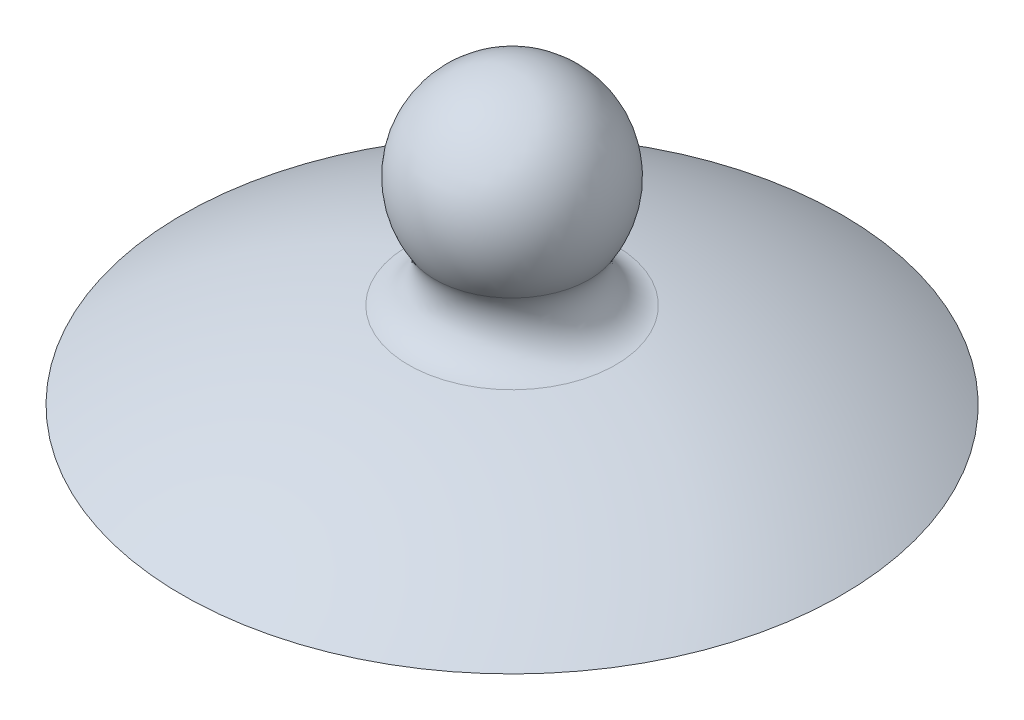
ISO-10303-21;
HEADER;
FILE_DESCRIPTION(('STEP AP214'),'2;1');
FILE_NAME('part.step','',(''),(''),'','','');
FILE_SCHEMA(('AUTOMOTIVE_DESIGN { 1 0 10303 214 1 1 1 1 }'));
ENDSEC;
DATA;
#1=APPLICATION_CONTEXT('core data for automotive mechanical design processes');
#2=APPLICATION_PROTOCOL_DEFINITION('international standard','automotive_design',2000,#1);
#3=PRODUCT_CONTEXT('',#1,'mechanical');
#4=PRODUCT('Part','Part','',(#3));
#5=PRODUCT_RELATED_PRODUCT_CATEGORY('part','',(#4));
#6=PRODUCT_DEFINITION_FORMATION('','',#4);
#7=PRODUCT_DEFINITION_CONTEXT('part definition',#1,'design');
#8=PRODUCT_DEFINITION('design','',#6,#7);
#9=PRODUCT_DEFINITION_SHAPE('','',#8);
#10=(LENGTH_UNIT() NAMED_UNIT(*) SI_UNIT(.MILLI.,.METRE.));
#11=(NAMED_UNIT(*) PLANE_ANGLE_UNIT() SI_UNIT($,.RADIAN.));
#12=(NAMED_UNIT(*) SI_UNIT($,.STERADIAN.) SOLID_ANGLE_UNIT());
#13=UNCERTAINTY_MEASURE_WITH_UNIT(LENGTH_MEASURE(1.E-05),#10,'distance_accuracy_value','');
#14=(GEOMETRIC_REPRESENTATION_CONTEXT(3) GLOBAL_UNCERTAINTY_ASSIGNED_CONTEXT((#13)) GLOBAL_UNIT_ASSIGNED_CONTEXT((#10,
#11,#12)) REPRESENTATION_CONTEXT('',''));
#15=CARTESIAN_POINT('',(0.,0.,0.));
#16=DIRECTION('',(0.,0.,1.));
#17=DIRECTION('',(1.,0.,0.));
#18=AXIS2_PLACEMENT_3D('',#15,#16,#17);
#19=CARTESIAN_POINT('',(0.,9.49826228150098,0.));
#20=DIRECTION('',(0.,-1.,0.));
#21=DIRECTION('',(0.,0.,-1.));
#22=AXIS2_PLACEMENT_3D('',#19,#20,#21);
#23=TOROIDAL_SURFACE('',#22,8.35050190568479,3.);
#24=CARTESIAN_POINT('',(0.,6.54039669555503,0.));
#25=DIRECTION('',(0.,-1.,0.));
#26=DIRECTION('',(0.,0.,-1.));
#27=AXIS2_PLACEMENT_3D('',#24,#25,#26);
#28=CIRCLE('',#27,7.8494717913437);
#29=CARTESIAN_POINT('',(0.,6.54039669555503,-7.8494717913437));
#30=VERTEX_POINT('',#29);
#31=EDGE_CURVE('E59',#30,#30,#28,.T.);
#32=ORIENTED_EDGE('',*,*,#31,.F.);
#33=EDGE_LOOP('',(#32));
#34=FACE_BOUND('',#33,.T.);
#35=CARTESIAN_POINT('',(0.,11.1487835970507,0.));
#36=DIRECTION('',(0.,-1.,0.));
#37=DIRECTION('',(0.,0.,-1.));
#38=AXIS2_PLACEMENT_3D('',#35,#36,#37);
#39=CIRCLE('',#38,5.84535133397935);
#40=CARTESIAN_POINT('',(0.,11.1487835970507,-5.84535133397935));
#41=VERTEX_POINT('',#40);
#42=EDGE_CURVE('E10',#41,#41,#39,.T.);
#43=ORIENTED_EDGE('',*,*,#42,.T.);
#44=EDGE_LOOP('',(#43));
#45=FACE_BOUND('',#44,.T.);
#46=ADVANCED_FACE('F34',(#34,#45),#23,.F.);
#47=CARTESIAN_POINT('',(0.,15.,0.));
#48=DIRECTION('',(0.,-1.,0.));
#49=DIRECTION('',(1.,0.,0.));
#50=AXIS2_PLACEMENT_3D('',#47,#48,#49);
#51=SPHERICAL_SURFACE('',#50,7.);
#52=ORIENTED_EDGE('',*,*,#42,.F.);
#53=EDGE_LOOP('',(#52));
#54=FACE_BOUND('',#53,.T.);
#55=ADVANCED_FACE('F67',(#54),#51,.T.);
#56=CARTESIAN_POINT('',(0.,0.,0.));
#57=DIRECTION('',(0.,-1.,0.));
#58=DIRECTION('',(0.,0.,-1.));
#59=AXIS2_PLACEMENT_3D('',#56,#57,#58);
#60=PLANE('',#59);
#61=CARTESIAN_POINT('',(0.,0.,0.));
#62=DIRECTION('',(0.,-1.,0.));
#63=DIRECTION('',(0.,0.,-1.));
#64=AXIS2_PLACEMENT_3D('',#61,#62,#63);
#65=CIRCLE('',#64,17.5);
#66=CARTESIAN_POINT('',(0.,0.,-17.5));
#67=VERTEX_POINT('',#66);
#68=EDGE_CURVE('E40',#67,#67,#65,.T.);
#69=ORIENTED_EDGE('',*,*,#68,.T.);
#70=EDGE_LOOP('',(#69));
#71=FACE_BOUND('',#70,.T.);
#72=ADVANCED_FACE('F71',(#71),#60,.T.);
#73=CARTESIAN_POINT('',(0.,0.,0.));
#74=DIRECTION('',(0.,-1.,0.));
#75=DIRECTION('',(0.,0.,-1.));
#76=AXIS2_PLACEMENT_3D('',#73,#74,#75);
#77=CYLINDRICAL_SURFACE('',#76,17.5);
#78=ORIENTED_EDGE('',*,*,#68,.F.);
#79=EDGE_LOOP('',(#78));
#80=FACE_BOUND('',#79,.T.);
#81=CARTESIAN_POINT('',(0.,-3.,0.));
#82=DIRECTION('',(0.,-1.,0.));
#83=DIRECTION('',(0.,0.,-1.));
#84=AXIS2_PLACEMENT_3D('',#81,#82,#83);
#85=CIRCLE('',#84,17.5);
#86=CARTESIAN_POINT('',(0.,-3.,-17.5));
#87=VERTEX_POINT('',#86);
#88=EDGE_CURVE('E44',#87,#87,#85,.T.);
#89=ORIENTED_EDGE('',*,*,#88,.T.);
#90=EDGE_LOOP('',(#89));
#91=FACE_BOUND('',#90,.T.);
#92=ADVANCED_FACE('F76',(#80,#91),#77,.F.);
#93=CARTESIAN_POINT('',(0.,-3.,0.));
#94=DIRECTION('',(0.,1.,0.));
#95=DIRECTION('',(0.,0.,1.));
#96=AXIS2_PLACEMENT_3D('',#93,#94,#95);
#97=PLANE('',#96);
#98=ORIENTED_EDGE('',*,*,#88,.F.);
#99=EDGE_LOOP('',(#98));
#100=FACE_BOUND('',#99,.T.);
#101=CARTESIAN_POINT('',(0.,-3.,0.));
#102=DIRECTION('',(0.,-1.,0.));
#103=DIRECTION('',(0.,0.,-1.));
#104=AXIS2_PLACEMENT_3D('',#101,#102,#103);
#105=CIRCLE('',#104,20.5);
#106=CARTESIAN_POINT('',(0.,-3.,-20.5));
#107=VERTEX_POINT('',#106);
#108=EDGE_CURVE('E48',#107,#107,#105,.T.);
#109=ORIENTED_EDGE('',*,*,#108,.T.);
#110=EDGE_LOOP('',(#109));
#111=FACE_BOUND('',#110,.T.);
#112=ADVANCED_FACE('F81',(#100,#111),#97,.F.);
#113=CARTESIAN_POINT('',(0.,0.,0.));
#114=DIRECTION('',(0.,-1.,0.));
#115=DIRECTION('',(0.,0.,-1.));
#116=AXIS2_PLACEMENT_3D('',#113,#114,#115);
#117=CYLINDRICAL_SURFACE('',#116,20.5);
#118=ORIENTED_EDGE('',*,*,#108,.F.);
#119=EDGE_LOOP('',(#118));
#120=FACE_BOUND('',#119,.T.);
#121=CARTESIAN_POINT('',(0.,0.,0.));
#122=DIRECTION('',(0.,-1.,0.));
#123=DIRECTION('',(0.,0.,-1.));
#124=AXIS2_PLACEMENT_3D('',#121,#122,#123);
#125=CIRCLE('',#124,20.5);
#126=CARTESIAN_POINT('',(0.,0.,-20.5));
#127=VERTEX_POINT('',#126);
#128=EDGE_CURVE('E53',#127,#127,#125,.T.);
#129=ORIENTED_EDGE('',*,*,#128,.T.);
#130=EDGE_LOOP('',(#129));
#131=FACE_BOUND('',#130,.T.);
#132=ADVANCED_FACE('F85',(#120,#131),#117,.T.);
#133=CARTESIAN_POINT('',(0.,0.,0.));
#134=DIRECTION('',(0.,-1.,0.));
#135=DIRECTION('',(0.,0.,-1.));
#136=AXIS2_PLACEMENT_3D('',#133,#134,#135);
#137=PLANE('',#136);
#138=CARTESIAN_POINT('',(0.,0.,0.));
#139=DIRECTION('',(0.,-1.,0.));
#140=DIRECTION('',(0.,0.,-1.));
#141=AXIS2_PLACEMENT_3D('',#138,#139,#140);
#142=CIRCLE('',#141,25.);
#143=CARTESIAN_POINT('',(0.,0.,-25.));
#144=VERTEX_POINT('',#143);
#145=EDGE_CURVE('E56',#144,#144,#142,.T.);
#146=ORIENTED_EDGE('',*,*,#145,.T.);
#147=EDGE_LOOP('',(#146));
#148=FACE_BOUND('',#147,.T.);
#149=ORIENTED_EDGE('',*,*,#128,.F.);
#150=EDGE_LOOP('',(#149));
#151=FACE_BOUND('',#150,.T.);
#152=ADVANCED_FACE('F89',(#148,#151),#137,.T.);
#153=CARTESIAN_POINT('',(0.,-39.7994974842648,0.));
#154=DIRECTION('',(0.,-1.,0.));
#155=DIRECTION('',(1.,0.,0.));
#156=AXIS2_PLACEMENT_3D('',#153,#154,#155);
#157=SPHERICAL_SURFACE('',#156,47.);
#158=ORIENTED_EDGE('',*,*,#31,.T.);
#159=EDGE_LOOP('',(#158));
#160=FACE_BOUND('',#159,.T.);
#161=ORIENTED_EDGE('',*,*,#145,.F.);
#162=EDGE_LOOP('',(#161));
#163=FACE_BOUND('',#162,.T.);
#164=ADVANCED_FACE('F63',(#160,#163),#157,.T.);
#165=CLOSED_SHELL('',(#46,#55,#72,#92,#112,#132,#152,#164));
#166=MANIFOLD_SOLID_BREP('B2',#165);
#167=ADVANCED_BREP_SHAPE_REPRESENTATION('',(#18,#166),#14);
#168=SHAPE_DEFINITION_REPRESENTATION(#9,#167);
ENDSEC;
END-ISO-10303-21;
